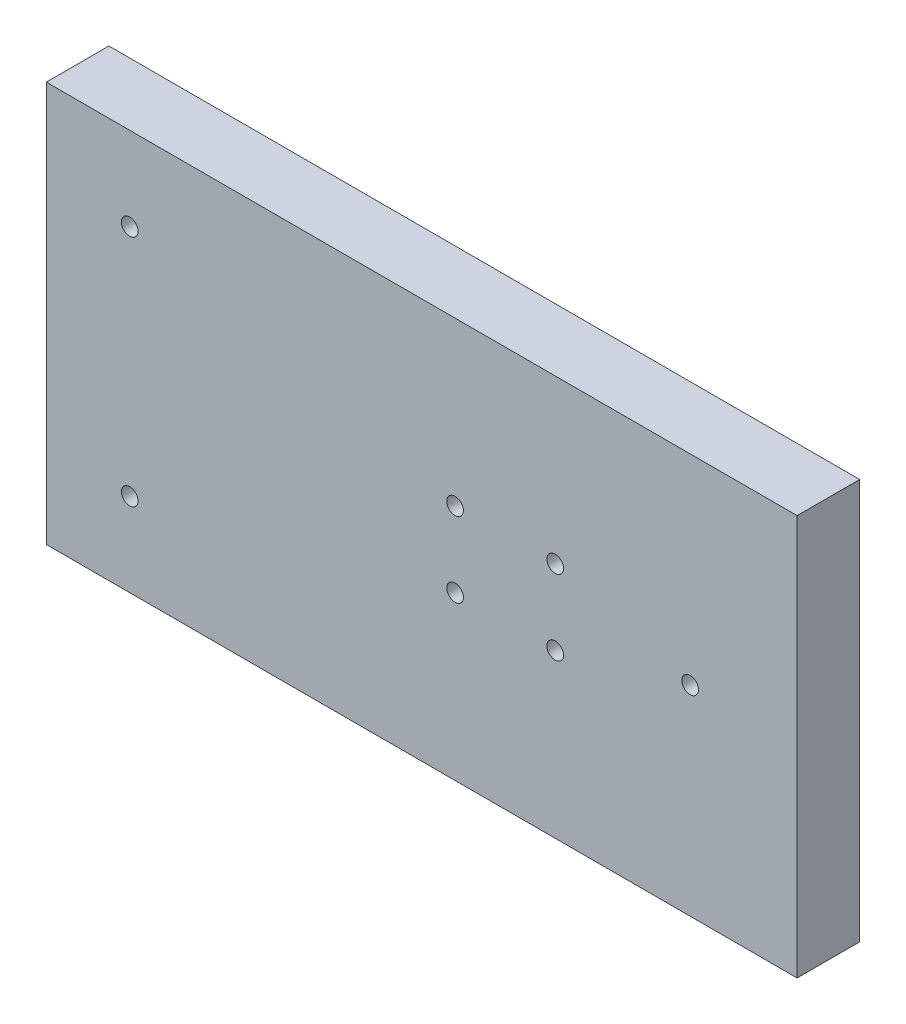
ISO-10303-21;
HEADER;
FILE_DESCRIPTION(('STEP AP214'),'2;1');
FILE_NAME('part.step','',(''),(''),'','','');
FILE_SCHEMA(('AUTOMOTIVE_DESIGN { 1 0 10303 214 1 1 1 1 }'));
ENDSEC;
DATA;
#1=APPLICATION_CONTEXT('core data for automotive mechanical design processes');
#2=APPLICATION_PROTOCOL_DEFINITION('international standard','automotive_design',2000,#1);
#3=PRODUCT_CONTEXT('',#1,'mechanical');
#4=PRODUCT('Part','Part','',(#3));
#5=PRODUCT_RELATED_PRODUCT_CATEGORY('part','',(#4));
#6=PRODUCT_DEFINITION_FORMATION('','',#4);
#7=PRODUCT_DEFINITION_CONTEXT('part definition',#1,'design');
#8=PRODUCT_DEFINITION('design','',#6,#7);
#9=PRODUCT_DEFINITION_SHAPE('','',#8);
#10=(LENGTH_UNIT() NAMED_UNIT(*) SI_UNIT(.MILLI.,.METRE.));
#11=(NAMED_UNIT(*) PLANE_ANGLE_UNIT() SI_UNIT($,.RADIAN.));
#12=(NAMED_UNIT(*) SI_UNIT($,.STERADIAN.) SOLID_ANGLE_UNIT());
#13=UNCERTAINTY_MEASURE_WITH_UNIT(LENGTH_MEASURE(1.E-05),#10,'distance_accuracy_value','');
#14=(GEOMETRIC_REPRESENTATION_CONTEXT(3) GLOBAL_UNCERTAINTY_ASSIGNED_CONTEXT((#13)) GLOBAL_UNIT_ASSIGNED_CONTEXT((#10,
#11,#12)) REPRESENTATION_CONTEXT('',''));
#15=CARTESIAN_POINT('',(0.,0.,0.));
#16=DIRECTION('',(0.,0.,1.));
#17=DIRECTION('',(1.,0.,0.));
#18=AXIS2_PLACEMENT_3D('',#15,#16,#17);
#19=CARTESIAN_POINT('',(0.,0.,15.));
#20=DIRECTION('',(0.,0.,-1.));
#21=DIRECTION('',(-1.,0.,0.));
#22=AXIS2_PLACEMENT_3D('',#19,#20,#21);
#23=PLANE('',#22);
#24=DIRECTION('',(0.,-1.,0.));
#25=VECTOR('',#24,1.);
#26=CARTESIAN_POINT('',(-705.534520474603,220.509389187346,15.));
#27=LINE('',#26,#25);
#28=CARTESIAN_POINT('',(-705.534520474603,316.509389187346,15.));
#29=VERTEX_POINT('',#28);
#30=CARTESIAN_POINT('',(-705.534520474603,220.509389187346,15.));
#31=VERTEX_POINT('',#30);
#32=EDGE_CURVE('E85',#29,#31,#27,.T.);
#33=ORIENTED_EDGE('',*,*,#32,.T.);
#34=DIRECTION('',(1.,0.,0.));
#35=VECTOR('',#34,1.);
#36=CARTESIAN_POINT('',(-705.534520474603,220.509389187346,15.));
#37=LINE('',#36,#35);
#38=CARTESIAN_POINT('',(-525.534520474603,220.509389187346,15.));
#39=VERTEX_POINT('',#38);
#40=EDGE_CURVE('E80',#31,#39,#37,.T.);
#41=ORIENTED_EDGE('',*,*,#40,.T.);
#42=DIRECTION('',(0.,1.,0.));
#43=VECTOR('',#42,1.);
#44=CARTESIAN_POINT('',(-525.534520474603,220.509389187346,15.));
#45=LINE('',#44,#43);
#46=CARTESIAN_POINT('',(-525.534520474603,316.509389187346,15.));
#47=VERTEX_POINT('',#46);
#48=EDGE_CURVE('E83',#39,#47,#45,.T.);
#49=ORIENTED_EDGE('',*,*,#48,.T.);
#50=DIRECTION('',(-1.,0.,0.));
#51=VECTOR('',#50,1.);
#52=CARTESIAN_POINT('',(-705.534520474603,316.509389187346,15.));
#53=LINE('',#52,#51);
#54=EDGE_CURVE('E50',#47,#29,#53,.T.);
#55=ORIENTED_EDGE('',*,*,#54,.T.);
#56=EDGE_LOOP('',(#33,#41,#49,#55));
#57=FACE_BOUND('',#56,.T.);
#58=CARTESIAN_POINT('',(-583.534520474603,277.509389187346,15.));
#59=DIRECTION('',(0.,0.,1.));
#60=DIRECTION('',(1.,0.,0.));
#61=AXIS2_PLACEMENT_3D('',#58,#59,#60);
#62=CIRCLE('',#61,2.);
#63=CARTESIAN_POINT('',(-581.534520474603,277.509389187346,15.));
#64=VERTEX_POINT('',#63);
#65=EDGE_CURVE('E100',#64,#64,#62,.T.);
#66=ORIENTED_EDGE('',*,*,#65,.F.);
#67=EDGE_LOOP('',(#66));
#68=FACE_BOUND('',#67,.T.);
#69=CARTESIAN_POINT('',(-685.534520474603,240.509389187346,15.));
#70=DIRECTION('',(0.,0.,1.));
#71=DIRECTION('',(1.,0.,0.));
#72=AXIS2_PLACEMENT_3D('',#69,#70,#71);
#73=CIRCLE('',#72,2.);
#74=CARTESIAN_POINT('',(-683.534520474603,240.509389187346,15.));
#75=VERTEX_POINT('',#74);
#76=EDGE_CURVE('E115',#75,#75,#73,.T.);
#77=ORIENTED_EDGE('',*,*,#76,.F.);
#78=EDGE_LOOP('',(#77));
#79=FACE_BOUND('',#78,.T.);
#80=CARTESIAN_POINT('',(-607.534520474603,277.509389187346,15.));
#81=DIRECTION('',(0.,0.,1.));
#82=DIRECTION('',(1.,0.,0.));
#83=AXIS2_PLACEMENT_3D('',#80,#81,#82);
#84=CIRCLE('',#83,2.);
#85=CARTESIAN_POINT('',(-605.534520474603,277.509389187346,15.));
#86=VERTEX_POINT('',#85);
#87=EDGE_CURVE('E121',#86,#86,#84,.T.);
#88=ORIENTED_EDGE('',*,*,#87,.F.);
#89=EDGE_LOOP('',(#88));
#90=FACE_BOUND('',#89,.T.);
#91=CARTESIAN_POINT('',(-551.183631115277,268.509389187346,15.));
#92=DIRECTION('',(0.,0.,1.));
#93=DIRECTION('',(1.,0.,0.));
#94=AXIS2_PLACEMENT_3D('',#91,#92,#93);
#95=CIRCLE('',#94,1.99999999998991);
#96=CARTESIAN_POINT('',(-549.183631115287,268.509389187346,15.));
#97=VERTEX_POINT('',#96);
#98=EDGE_CURVE('E127',#97,#97,#95,.T.);
#99=ORIENTED_EDGE('',*,*,#98,.F.);
#100=EDGE_LOOP('',(#99));
#101=FACE_BOUND('',#100,.T.);
#102=CARTESIAN_POINT('',(-583.534520474603,259.509389187346,15.));
#103=DIRECTION('',(0.,0.,1.));
#104=DIRECTION('',(1.,0.,0.));
#105=AXIS2_PLACEMENT_3D('',#102,#103,#104);
#106=CIRCLE('',#105,2.);
#107=CARTESIAN_POINT('',(-581.534520474603,259.509389187346,15.));
#108=VERTEX_POINT('',#107);
#109=EDGE_CURVE('E133',#108,#108,#106,.T.);
#110=ORIENTED_EDGE('',*,*,#109,.F.);
#111=EDGE_LOOP('',(#110));
#112=FACE_BOUND('',#111,.T.);
#113=CARTESIAN_POINT('',(-607.534520474603,259.509389187346,15.));
#114=DIRECTION('',(0.,0.,1.));
#115=DIRECTION('',(1.,0.,0.));
#116=AXIS2_PLACEMENT_3D('',#113,#114,#115);
#117=CIRCLE('',#116,2.);
#118=CARTESIAN_POINT('',(-605.534520474603,259.509389187346,15.));
#119=VERTEX_POINT('',#118);
#120=EDGE_CURVE('E139',#119,#119,#117,.T.);
#121=ORIENTED_EDGE('',*,*,#120,.F.);
#122=EDGE_LOOP('',(#121));
#123=FACE_BOUND('',#122,.T.);
#124=CARTESIAN_POINT('',(-685.534520474603,296.509389187346,15.));
#125=DIRECTION('',(0.,0.,1.));
#126=DIRECTION('',(1.,0.,0.));
#127=AXIS2_PLACEMENT_3D('',#124,#125,#126);
#128=CIRCLE('',#127,2.);
#129=CARTESIAN_POINT('',(-683.534520474603,296.509389187346,15.));
#130=VERTEX_POINT('',#129);
#131=EDGE_CURVE('E145',#130,#130,#128,.T.);
#132=ORIENTED_EDGE('',*,*,#131,.F.);
#133=EDGE_LOOP('',(#132));
#134=FACE_BOUND('',#133,.T.);
#135=ADVANCED_FACE('F33',(#57,#68,#79,#90,#101,#112,#123,#134),#23,.F.);
#136=CARTESIAN_POINT('',(0.,0.,0.));
#137=DIRECTION('',(0.,0.,-1.));
#138=DIRECTION('',(-1.,0.,0.));
#139=AXIS2_PLACEMENT_3D('',#136,#137,#138);
#140=PLANE('',#139);
#141=CARTESIAN_POINT('',(-607.534520474603,259.509389187346,0.));
#142=DIRECTION('',(0.,0.,1.));
#143=DIRECTION('',(1.,0.,0.));
#144=AXIS2_PLACEMENT_3D('',#141,#142,#143);
#145=CIRCLE('',#144,2.);
#146=CARTESIAN_POINT('',(-605.534520474603,259.509389187346,0.));
#147=VERTEX_POINT('',#146);
#148=EDGE_CURVE('E142',#147,#147,#145,.T.);
#149=ORIENTED_EDGE('',*,*,#148,.T.);
#150=EDGE_LOOP('',(#149));
#151=FACE_BOUND('',#150,.T.);
#152=CARTESIAN_POINT('',(-551.183631115277,268.509389187346,0.));
#153=DIRECTION('',(0.,0.,1.));
#154=DIRECTION('',(1.,0.,0.));
#155=AXIS2_PLACEMENT_3D('',#152,#153,#154);
#156=CIRCLE('',#155,1.99999999998991);
#157=CARTESIAN_POINT('',(-549.183631115287,268.509389187346,0.));
#158=VERTEX_POINT('',#157);
#159=EDGE_CURVE('E130',#158,#158,#156,.T.);
#160=ORIENTED_EDGE('',*,*,#159,.T.);
#161=EDGE_LOOP('',(#160));
#162=FACE_BOUND('',#161,.T.);
#163=CARTESIAN_POINT('',(-685.534520474603,240.509389187346,0.));
#164=DIRECTION('',(0.,0.,1.));
#165=DIRECTION('',(1.,0.,0.));
#166=AXIS2_PLACEMENT_3D('',#163,#164,#165);
#167=CIRCLE('',#166,2.);
#168=CARTESIAN_POINT('',(-683.534520474603,240.509389187346,0.));
#169=VERTEX_POINT('',#168);
#170=EDGE_CURVE('E118',#169,#169,#167,.T.);
#171=ORIENTED_EDGE('',*,*,#170,.T.);
#172=EDGE_LOOP('',(#171));
#173=FACE_BOUND('',#172,.T.);
#174=DIRECTION('',(0.,-1.,0.));
#175=VECTOR('',#174,1.);
#176=CARTESIAN_POINT('',(-705.534520474603,220.509389187346,0.));
#177=LINE('',#176,#175);
#178=CARTESIAN_POINT('',(-705.534520474603,316.509389187346,0.));
#179=VERTEX_POINT('',#178);
#180=CARTESIAN_POINT('',(-705.534520474603,220.509389187346,0.));
#181=VERTEX_POINT('',#180);
#182=EDGE_CURVE('E97',#179,#181,#177,.T.);
#183=ORIENTED_EDGE('',*,*,#182,.F.);
#184=DIRECTION('',(-1.,0.,0.));
#185=VECTOR('',#184,1.);
#186=CARTESIAN_POINT('',(-705.534520474603,316.509389187346,0.));
#187=LINE('',#186,#185);
#188=CARTESIAN_POINT('',(-525.534520474603,316.509389187346,0.));
#189=VERTEX_POINT('',#188);
#190=EDGE_CURVE('E73',#189,#179,#187,.T.);
#191=ORIENTED_EDGE('',*,*,#190,.F.);
#192=DIRECTION('',(0.,1.,0.));
#193=VECTOR('',#192,1.);
#194=CARTESIAN_POINT('',(-525.534520474603,220.509389187346,0.));
#195=LINE('',#194,#193);
#196=CARTESIAN_POINT('',(-525.534520474603,220.509389187346,0.));
#197=VERTEX_POINT('',#196);
#198=EDGE_CURVE('E67',#197,#189,#195,.T.);
#199=ORIENTED_EDGE('',*,*,#198,.F.);
#200=DIRECTION('',(1.,0.,0.));
#201=VECTOR('',#200,1.);
#202=CARTESIAN_POINT('',(-705.534520474603,220.509389187346,0.));
#203=LINE('',#202,#201);
#204=EDGE_CURVE('E89',#181,#197,#203,.T.);
#205=ORIENTED_EDGE('',*,*,#204,.F.);
#206=EDGE_LOOP('',(#183,#191,#199,#205));
#207=FACE_BOUND('',#206,.T.);
#208=CARTESIAN_POINT('',(-583.534520474603,277.509389187346,0.));
#209=DIRECTION('',(0.,0.,1.));
#210=DIRECTION('',(1.,0.,0.));
#211=AXIS2_PLACEMENT_3D('',#208,#209,#210);
#212=CIRCLE('',#211,2.);
#213=CARTESIAN_POINT('',(-581.534520474603,277.509389187346,0.));
#214=VERTEX_POINT('',#213);
#215=EDGE_CURVE('E112',#214,#214,#212,.T.);
#216=ORIENTED_EDGE('',*,*,#215,.T.);
#217=EDGE_LOOP('',(#216));
#218=FACE_BOUND('',#217,.T.);
#219=CARTESIAN_POINT('',(-607.534520474603,277.509389187346,0.));
#220=DIRECTION('',(0.,0.,1.));
#221=DIRECTION('',(1.,0.,0.));
#222=AXIS2_PLACEMENT_3D('',#219,#220,#221);
#223=CIRCLE('',#222,2.);
#224=CARTESIAN_POINT('',(-605.534520474603,277.509389187346,0.));
#225=VERTEX_POINT('',#224);
#226=EDGE_CURVE('E124',#225,#225,#223,.T.);
#227=ORIENTED_EDGE('',*,*,#226,.T.);
#228=EDGE_LOOP('',(#227));
#229=FACE_BOUND('',#228,.T.);
#230=CARTESIAN_POINT('',(-583.534520474603,259.509389187346,0.));
#231=DIRECTION('',(0.,0.,1.));
#232=DIRECTION('',(1.,0.,0.));
#233=AXIS2_PLACEMENT_3D('',#230,#231,#232);
#234=CIRCLE('',#233,2.);
#235=CARTESIAN_POINT('',(-581.534520474603,259.509389187346,0.));
#236=VERTEX_POINT('',#235);
#237=EDGE_CURVE('E136',#236,#236,#234,.T.);
#238=ORIENTED_EDGE('',*,*,#237,.T.);
#239=EDGE_LOOP('',(#238));
#240=FACE_BOUND('',#239,.T.);
#241=CARTESIAN_POINT('',(-685.534520474603,296.509389187346,0.));
#242=DIRECTION('',(0.,0.,1.));
#243=DIRECTION('',(1.,0.,0.));
#244=AXIS2_PLACEMENT_3D('',#241,#242,#243);
#245=CIRCLE('',#244,2.);
#246=CARTESIAN_POINT('',(-683.534520474603,296.509389187346,0.));
#247=VERTEX_POINT('',#246);
#248=EDGE_CURVE('E148',#247,#247,#245,.T.);
#249=ORIENTED_EDGE('',*,*,#248,.T.);
#250=EDGE_LOOP('',(#249));
#251=FACE_BOUND('',#250,.T.);
#252=ADVANCED_FACE('F108',(#151,#162,#173,#207,#218,#229,#240,#251),#140,.T.);
#253=CARTESIAN_POINT('',(-705.534520474603,220.509389187346,15.));
#254=DIRECTION('',(1.,0.,0.));
#255=DIRECTION('',(0.,0.,-1.));
#256=AXIS2_PLACEMENT_3D('',#253,#254,#255);
#257=PLANE('',#256);
#258=ORIENTED_EDGE('',*,*,#182,.T.);
#259=DIRECTION('',(0.,0.,-1.));
#260=VECTOR('',#259,1.);
#261=CARTESIAN_POINT('',(-705.534520474603,220.509389187346,15.));
#262=LINE('',#261,#260);
#263=EDGE_CURVE('E11',#31,#181,#262,.T.);
#264=ORIENTED_EDGE('',*,*,#263,.F.);
#265=ORIENTED_EDGE('',*,*,#32,.F.);
#266=DIRECTION('',(0.,0.,-1.));
#267=VECTOR('',#266,1.);
#268=CARTESIAN_POINT('',(-705.534520474603,316.509389187346,15.));
#269=LINE('',#268,#267);
#270=EDGE_CURVE('E93',#29,#179,#269,.T.);
#271=ORIENTED_EDGE('',*,*,#270,.T.);
#272=EDGE_LOOP('',(#258,#264,#265,#271));
#273=FACE_BOUND('',#272,.T.);
#274=ADVANCED_FACE('F35',(#273),#257,.F.);
#275=CARTESIAN_POINT('',(-705.534520474603,220.509389187346,15.));
#276=DIRECTION('',(0.,1.,0.));
#277=DIRECTION('',(-1.,0.,0.));
#278=AXIS2_PLACEMENT_3D('',#275,#276,#277);
#279=PLANE('',#278);
#280=ORIENTED_EDGE('',*,*,#204,.T.);
#281=DIRECTION('',(0.,0.,-1.));
#282=VECTOR('',#281,1.);
#283=CARTESIAN_POINT('',(-525.534520474603,220.509389187346,15.));
#284=LINE('',#283,#282);
#285=EDGE_CURVE('E42',#39,#197,#284,.T.);
#286=ORIENTED_EDGE('',*,*,#285,.F.);
#287=ORIENTED_EDGE('',*,*,#40,.F.);
#288=ORIENTED_EDGE('',*,*,#263,.T.);
#289=EDGE_LOOP('',(#280,#286,#287,#288));
#290=FACE_BOUND('',#289,.T.);
#291=ADVANCED_FACE('F88',(#290),#279,.F.);
#292=CARTESIAN_POINT('',(-525.534520474603,220.509389187346,15.));
#293=DIRECTION('',(-1.,0.,0.));
#294=DIRECTION('',(0.,0.,1.));
#295=AXIS2_PLACEMENT_3D('',#292,#293,#294);
#296=PLANE('',#295);
#297=ORIENTED_EDGE('',*,*,#198,.T.);
#298=DIRECTION('',(0.,0.,-1.));
#299=VECTOR('',#298,1.);
#300=CARTESIAN_POINT('',(-525.534520474603,316.509389187346,15.));
#301=LINE('',#300,#299);
#302=EDGE_CURVE('E90',#47,#189,#301,.T.);
#303=ORIENTED_EDGE('',*,*,#302,.F.);
#304=ORIENTED_EDGE('',*,*,#48,.F.);
#305=ORIENTED_EDGE('',*,*,#285,.T.);
#306=EDGE_LOOP('',(#297,#303,#304,#305));
#307=FACE_BOUND('',#306,.T.);
#308=ADVANCED_FACE('F91',(#307),#296,.F.);
#309=CARTESIAN_POINT('',(-705.534520474603,316.509389187346,15.));
#310=DIRECTION('',(0.,-1.,0.));
#311=DIRECTION('',(1.,0.,0.));
#312=AXIS2_PLACEMENT_3D('',#309,#310,#311);
#313=PLANE('',#312);
#314=ORIENTED_EDGE('',*,*,#190,.T.);
#315=ORIENTED_EDGE('',*,*,#270,.F.);
#316=ORIENTED_EDGE('',*,*,#54,.F.);
#317=ORIENTED_EDGE('',*,*,#302,.T.);
#318=EDGE_LOOP('',(#314,#315,#316,#317));
#319=FACE_BOUND('',#318,.T.);
#320=ADVANCED_FACE('F105',(#319),#313,.F.);
#321=CARTESIAN_POINT('',(-583.534520474603,277.509389187346,15.));
#322=DIRECTION('',(0.,0.,-1.));
#323=DIRECTION('',(-1.,0.,0.));
#324=AXIS2_PLACEMENT_3D('',#321,#322,#323);
#325=CYLINDRICAL_SURFACE('',#324,2.);
#326=ORIENTED_EDGE('',*,*,#65,.T.);
#327=EDGE_LOOP('',(#326));
#328=FACE_BOUND('',#327,.T.);
#329=ORIENTED_EDGE('',*,*,#215,.F.);
#330=EDGE_LOOP('',(#329));
#331=FACE_BOUND('',#330,.T.);
#332=ADVANCED_FACE('F165',(#328,#331),#325,.F.);
#333=CARTESIAN_POINT('',(-685.534520474603,240.509389187346,15.));
#334=DIRECTION('',(0.,0.,-1.));
#335=DIRECTION('',(-1.,0.,0.));
#336=AXIS2_PLACEMENT_3D('',#333,#334,#335);
#337=CYLINDRICAL_SURFACE('',#336,2.);
#338=ORIENTED_EDGE('',*,*,#76,.T.);
#339=EDGE_LOOP('',(#338));
#340=FACE_BOUND('',#339,.T.);
#341=ORIENTED_EDGE('',*,*,#170,.F.);
#342=EDGE_LOOP('',(#341));
#343=FACE_BOUND('',#342,.T.);
#344=ADVANCED_FACE('F211',(#340,#343),#337,.F.);
#345=CARTESIAN_POINT('',(-607.534520474603,277.509389187346,15.));
#346=DIRECTION('',(0.,0.,-1.));
#347=DIRECTION('',(-1.,0.,0.));
#348=AXIS2_PLACEMENT_3D('',#345,#346,#347);
#349=CYLINDRICAL_SURFACE('',#348,2.);
#350=ORIENTED_EDGE('',*,*,#87,.T.);
#351=EDGE_LOOP('',(#350));
#352=FACE_BOUND('',#351,.T.);
#353=ORIENTED_EDGE('',*,*,#226,.F.);
#354=EDGE_LOOP('',(#353));
#355=FACE_BOUND('',#354,.T.);
#356=ADVANCED_FACE('F219',(#352,#355),#349,.F.);
#357=CARTESIAN_POINT('',(-551.183631115277,268.509389187346,15.));
#358=DIRECTION('',(0.,0.,-1.));
#359=DIRECTION('',(-1.,0.,0.));
#360=AXIS2_PLACEMENT_3D('',#357,#358,#359);
#361=CYLINDRICAL_SURFACE('',#360,1.99999999998991);
#362=ORIENTED_EDGE('',*,*,#98,.T.);
#363=EDGE_LOOP('',(#362));
#364=FACE_BOUND('',#363,.T.);
#365=ORIENTED_EDGE('',*,*,#159,.F.);
#366=EDGE_LOOP('',(#365));
#367=FACE_BOUND('',#366,.T.);
#368=ADVANCED_FACE('F227',(#364,#367),#361,.F.);
#369=CARTESIAN_POINT('',(-583.534520474603,259.509389187346,15.));
#370=DIRECTION('',(0.,0.,-1.));
#371=DIRECTION('',(-1.,0.,0.));
#372=AXIS2_PLACEMENT_3D('',#369,#370,#371);
#373=CYLINDRICAL_SURFACE('',#372,2.);
#374=ORIENTED_EDGE('',*,*,#109,.T.);
#375=EDGE_LOOP('',(#374));
#376=FACE_BOUND('',#375,.T.);
#377=ORIENTED_EDGE('',*,*,#237,.F.);
#378=EDGE_LOOP('',(#377));
#379=FACE_BOUND('',#378,.T.);
#380=ADVANCED_FACE('F236',(#376,#379),#373,.F.);
#381=CARTESIAN_POINT('',(-607.534520474603,259.509389187346,15.));
#382=DIRECTION('',(0.,0.,-1.));
#383=DIRECTION('',(-1.,0.,0.));
#384=AXIS2_PLACEMENT_3D('',#381,#382,#383);
#385=CYLINDRICAL_SURFACE('',#384,2.);
#386=ORIENTED_EDGE('',*,*,#120,.T.);
#387=EDGE_LOOP('',(#386));
#388=FACE_BOUND('',#387,.T.);
#389=ORIENTED_EDGE('',*,*,#148,.F.);
#390=EDGE_LOOP('',(#389));
#391=FACE_BOUND('',#390,.T.);
#392=ADVANCED_FACE('F245',(#388,#391),#385,.F.);
#393=CARTESIAN_POINT('',(-685.534520474603,296.509389187346,15.));
#394=DIRECTION('',(0.,0.,-1.));
#395=DIRECTION('',(-1.,0.,0.));
#396=AXIS2_PLACEMENT_3D('',#393,#394,#395);
#397=CYLINDRICAL_SURFACE('',#396,2.);
#398=ORIENTED_EDGE('',*,*,#131,.T.);
#399=EDGE_LOOP('',(#398));
#400=FACE_BOUND('',#399,.T.);
#401=ORIENTED_EDGE('',*,*,#248,.F.);
#402=EDGE_LOOP('',(#401));
#403=FACE_BOUND('',#402,.T.);
#404=ADVANCED_FACE('F154',(#400,#403),#397,.F.);
#405=CLOSED_SHELL('',(#135,#252,#274,#291,#308,#320,#332,#344,#356,#368,#380,#392,#404));
#406=MANIFOLD_SOLID_BREP('B2',#405);
#407=ADVANCED_BREP_SHAPE_REPRESENTATION('',(#18,#406),#14);
#408=SHAPE_DEFINITION_REPRESENTATION(#9,#407);
ENDSEC;
END-ISO-10303-21;
